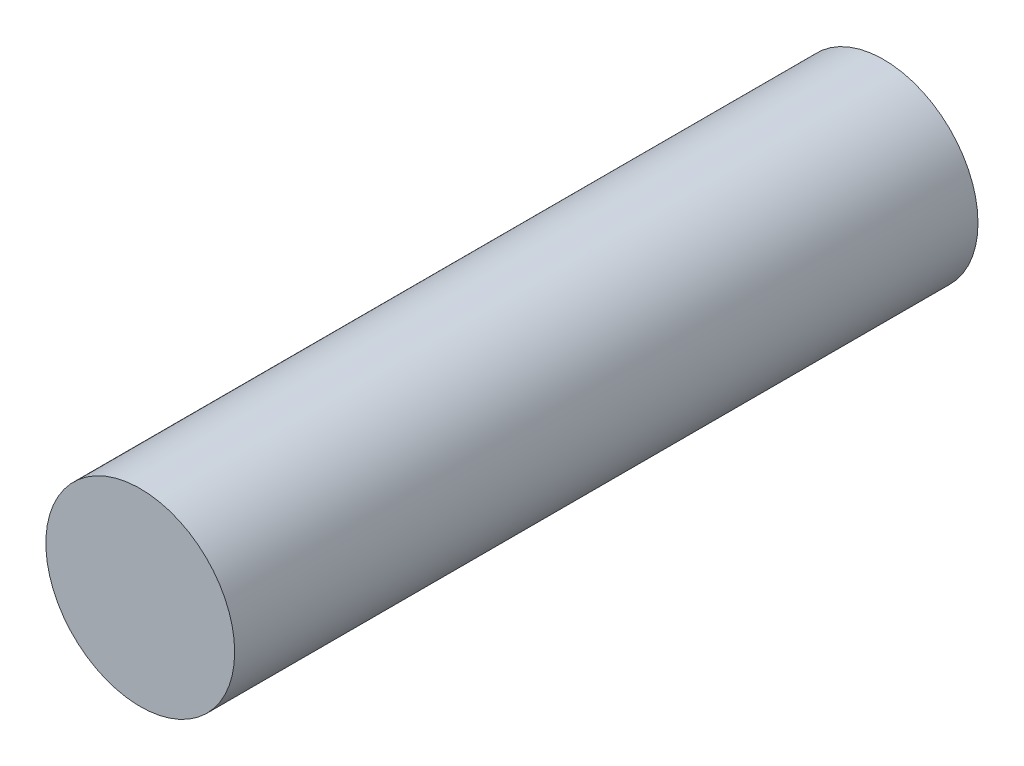
ISO-10303-21;
HEADER;
FILE_DESCRIPTION(('STEP AP214'),'2;1');
FILE_NAME('part.step','',(''),(''),'','','');
FILE_SCHEMA(('AUTOMOTIVE_DESIGN { 1 0 10303 214 1 1 1 1 }'));
ENDSEC;
DATA;
#1=APPLICATION_CONTEXT('core data for automotive mechanical design processes');
#2=APPLICATION_PROTOCOL_DEFINITION('international standard','automotive_design',2000,#1);
#3=PRODUCT_CONTEXT('',#1,'mechanical');
#4=PRODUCT('Part','Part','',(#3));
#5=PRODUCT_RELATED_PRODUCT_CATEGORY('part','',(#4));
#6=PRODUCT_DEFINITION_FORMATION('','',#4);
#7=PRODUCT_DEFINITION_CONTEXT('part definition',#1,'design');
#8=PRODUCT_DEFINITION('design','',#6,#7);
#9=PRODUCT_DEFINITION_SHAPE('','',#8);
#10=(LENGTH_UNIT() NAMED_UNIT(*) SI_UNIT(.MILLI.,.METRE.));
#11=(NAMED_UNIT(*) PLANE_ANGLE_UNIT() SI_UNIT($,.RADIAN.));
#12=(NAMED_UNIT(*) SI_UNIT($,.STERADIAN.) SOLID_ANGLE_UNIT());
#13=UNCERTAINTY_MEASURE_WITH_UNIT(LENGTH_MEASURE(1.E-05),#10,'distance_accuracy_value','');
#14=(GEOMETRIC_REPRESENTATION_CONTEXT(3) GLOBAL_UNCERTAINTY_ASSIGNED_CONTEXT((#13)) GLOBAL_UNIT_ASSIGNED_CONTEXT((#10,
#11,#12)) REPRESENTATION_CONTEXT('',''));
#15=CARTESIAN_POINT('',(0.,0.,0.));
#16=DIRECTION('',(0.,0.,1.));
#17=DIRECTION('',(1.,0.,0.));
#18=AXIS2_PLACEMENT_3D('',#15,#16,#17);
#19=CARTESIAN_POINT('',(0.,0.,50.));
#20=DIRECTION('',(0.,0.,-1.));
#21=DIRECTION('',(-1.,0.,0.));
#22=AXIS2_PLACEMENT_3D('',#19,#20,#21);
#23=CYLINDRICAL_SURFACE('',#22,6.35);
#24=CARTESIAN_POINT('',(0.,0.,50.));
#25=DIRECTION('',(0.,0.,1.));
#26=DIRECTION('',(1.,0.,0.));
#27=AXIS2_PLACEMENT_3D('',#24,#25,#26);
#28=CIRCLE('',#27,6.35);
#29=CARTESIAN_POINT('',(6.35,0.,50.));
#30=VERTEX_POINT('',#29);
#31=EDGE_CURVE('E10',#30,#30,#28,.T.);
#32=ORIENTED_EDGE('',*,*,#31,.F.);
#33=EDGE_LOOP('',(#32));
#34=FACE_BOUND('',#33,.T.);
#35=CARTESIAN_POINT('',(0.,0.,0.));
#36=DIRECTION('',(0.,0.,1.));
#37=DIRECTION('',(1.,0.,0.));
#38=AXIS2_PLACEMENT_3D('',#35,#36,#37);
#39=CIRCLE('',#38,6.35);
#40=CARTESIAN_POINT('',(6.35,0.,0.));
#41=VERTEX_POINT('',#40);
#42=EDGE_CURVE('E37',#41,#41,#39,.T.);
#43=ORIENTED_EDGE('',*,*,#42,.T.);
#44=EDGE_LOOP('',(#43));
#45=FACE_BOUND('',#44,.T.);
#46=ADVANCED_FACE('F34',(#34,#45),#23,.T.);
#47=CARTESIAN_POINT('',(0.,0.,50.));
#48=DIRECTION('',(0.,0.,1.));
#49=DIRECTION('',(1.,0.,0.));
#50=AXIS2_PLACEMENT_3D('',#47,#48,#49);
#51=PLANE('',#50);
#52=ORIENTED_EDGE('',*,*,#31,.T.);
#53=EDGE_LOOP('',(#52));
#54=FACE_BOUND('',#53,.T.);
#55=ADVANCED_FACE('F51',(#54),#51,.T.);
#56=CARTESIAN_POINT('',(0.,0.,0.));
#57=DIRECTION('',(0.,0.,1.));
#58=DIRECTION('',(1.,0.,0.));
#59=AXIS2_PLACEMENT_3D('',#56,#57,#58);
#60=PLANE('',#59);
#61=ORIENTED_EDGE('',*,*,#42,.F.);
#62=EDGE_LOOP('',(#61));
#63=FACE_BOUND('',#62,.T.);
#64=ADVANCED_FACE('F49',(#63),#60,.F.);
#65=CLOSED_SHELL('',(#46,#55,#64));
#66=MANIFOLD_SOLID_BREP('B2',#65);
#67=ADVANCED_BREP_SHAPE_REPRESENTATION('',(#18,#66),#14);
#68=SHAPE_DEFINITION_REPRESENTATION(#9,#67);
ENDSEC;
END-ISO-10303-21;
